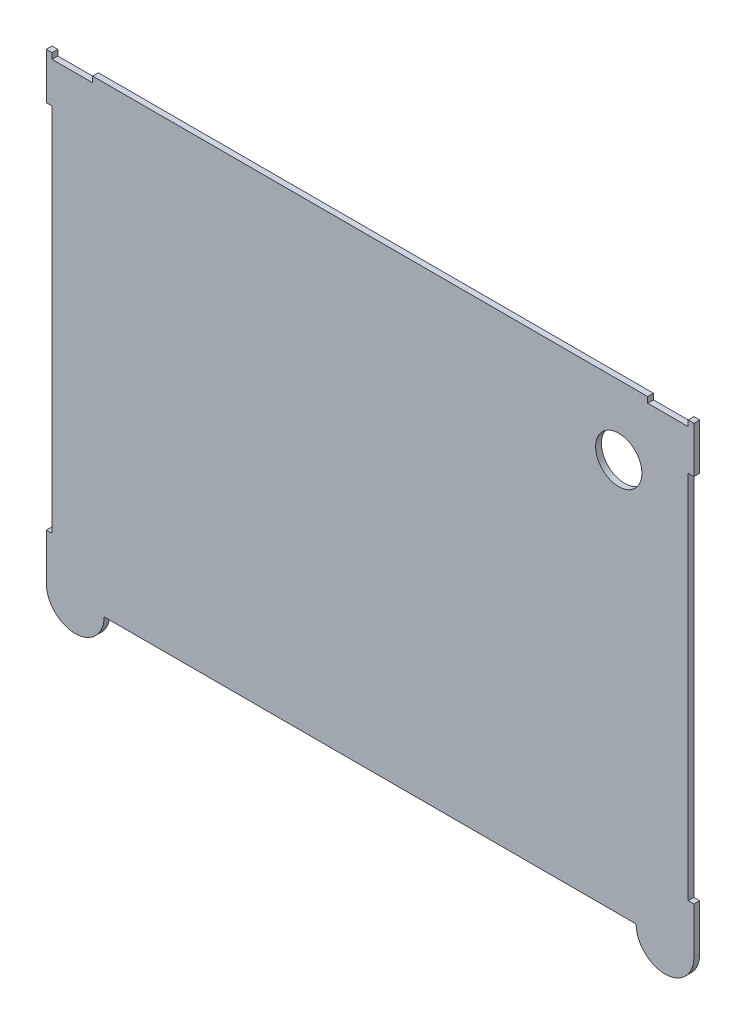
ISO-10303-21;
HEADER;
FILE_DESCRIPTION(('STEP AP214'),'2;1');
FILE_NAME('part.step','',(''),(''),'','','');
FILE_SCHEMA(('AUTOMOTIVE_DESIGN { 1 0 10303 214 1 1 1 1 }'));
ENDSEC;
DATA;
#1=APPLICATION_CONTEXT('core data for automotive mechanical design processes');
#2=APPLICATION_PROTOCOL_DEFINITION('international standard','automotive_design',2000,#1);
#3=PRODUCT_CONTEXT('',#1,'mechanical');
#4=PRODUCT('Part','Part','',(#3));
#5=PRODUCT_RELATED_PRODUCT_CATEGORY('part','',(#4));
#6=PRODUCT_DEFINITION_FORMATION('','',#4);
#7=PRODUCT_DEFINITION_CONTEXT('part definition',#1,'design');
#8=PRODUCT_DEFINITION('design','',#6,#7);
#9=PRODUCT_DEFINITION_SHAPE('','',#8);
#10=(LENGTH_UNIT() NAMED_UNIT(*) SI_UNIT(.MILLI.,.METRE.));
#11=(NAMED_UNIT(*) PLANE_ANGLE_UNIT() SI_UNIT($,.RADIAN.));
#12=(NAMED_UNIT(*) SI_UNIT($,.STERADIAN.) SOLID_ANGLE_UNIT());
#13=UNCERTAINTY_MEASURE_WITH_UNIT(LENGTH_MEASURE(1.E-05),#10,'distance_accuracy_value','');
#14=(GEOMETRIC_REPRESENTATION_CONTEXT(3) GLOBAL_UNCERTAINTY_ASSIGNED_CONTEXT((#13)) GLOBAL_UNIT_ASSIGNED_CONTEXT((#10,
#11,#12)) REPRESENTATION_CONTEXT('',''));
#15=CARTESIAN_POINT('',(0.,0.,0.));
#16=DIRECTION('',(0.,0.,1.));
#17=DIRECTION('',(1.,0.,0.));
#18=AXIS2_PLACEMENT_3D('',#15,#16,#17);
#19=CARTESIAN_POINT('',(15.875,0.,3.175));
#20=DIRECTION('',(0.,0.,-1.));
#21=DIRECTION('',(-1.,0.,0.));
#22=AXIS2_PLACEMENT_3D('',#19,#20,#21);
#23=CYLINDRICAL_SURFACE('',#22,15.875);
#24=CARTESIAN_POINT('',(15.875,0.,0.));
#25=DIRECTION('',(0.,0.,1.));
#26=DIRECTION('',(1.,0.,0.));
#27=AXIS2_PLACEMENT_3D('',#24,#25,#26);
#28=CIRCLE('',#27,15.875);
#29=CARTESIAN_POINT('',(0.,0.,0.));
#30=VERTEX_POINT('',#29);
#31=CARTESIAN_POINT('',(31.75,0.,0.));
#32=VERTEX_POINT('',#31);
#33=EDGE_CURVE('E214',#30,#32,#28,.T.);
#34=ORIENTED_EDGE('',*,*,#33,.T.);
#35=DIRECTION('',(0.,0.,-1.));
#36=VECTOR('',#35,1.);
#37=CARTESIAN_POINT('',(31.75,0.,3.175));
#38=LINE('',#37,#36);
#39=CARTESIAN_POINT('',(31.75,0.,3.175));
#40=VERTEX_POINT('',#39);
#41=EDGE_CURVE('E11',#40,#32,#38,.T.);
#42=ORIENTED_EDGE('',*,*,#41,.F.);
#43=CARTESIAN_POINT('',(15.875,0.,3.175));
#44=DIRECTION('',(0.,0.,1.));
#45=DIRECTION('',(1.,0.,0.));
#46=AXIS2_PLACEMENT_3D('',#43,#44,#45);
#47=CIRCLE('',#46,15.875);
#48=CARTESIAN_POINT('',(0.,0.,3.175));
#49=VERTEX_POINT('',#48);
#50=EDGE_CURVE('E259',#49,#40,#47,.T.);
#51=ORIENTED_EDGE('',*,*,#50,.F.);
#52=DIRECTION('',(0.,0.,-1.));
#53=VECTOR('',#52,1.);
#54=CARTESIAN_POINT('',(0.,0.,3.175));
#55=LINE('',#54,#53);
#56=EDGE_CURVE('E210',#49,#30,#55,.T.);
#57=ORIENTED_EDGE('',*,*,#56,.T.);
#58=EDGE_LOOP('',(#34,#42,#51,#57));
#59=FACE_BOUND('',#58,.T.);
#60=ADVANCED_FACE('F34',(#59),#23,.T.);
#61=CARTESIAN_POINT('',(31.75,0.,3.175));
#62=DIRECTION('',(0.,1.,0.));
#63=DIRECTION('',(0.,0.,1.));
#64=AXIS2_PLACEMENT_3D('',#61,#62,#63);
#65=PLANE('',#64);
#66=DIRECTION('',(1.,0.,0.));
#67=VECTOR('',#66,1.);
#68=CARTESIAN_POINT('',(31.75,0.,0.));
#69=LINE('',#68,#67);
#70=CARTESIAN_POINT('',(323.85,0.,0.));
#71=VERTEX_POINT('',#70);
#72=EDGE_CURVE('E217',#32,#71,#69,.T.);
#73=ORIENTED_EDGE('',*,*,#72,.T.);
#74=DIRECTION('',(0.,0.,-1.));
#75=VECTOR('',#74,1.);
#76=CARTESIAN_POINT('',(323.85,0.,3.175));
#77=LINE('',#76,#75);
#78=CARTESIAN_POINT('',(323.85,0.,3.175));
#79=VERTEX_POINT('',#78);
#80=EDGE_CURVE('E42',#79,#71,#77,.T.);
#81=ORIENTED_EDGE('',*,*,#80,.F.);
#82=DIRECTION('',(1.,0.,0.));
#83=VECTOR('',#82,1.);
#84=CARTESIAN_POINT('',(31.75,0.,3.175));
#85=LINE('',#84,#83);
#86=EDGE_CURVE('E135',#40,#79,#85,.T.);
#87=ORIENTED_EDGE('',*,*,#86,.F.);
#88=ORIENTED_EDGE('',*,*,#41,.T.);
#89=EDGE_LOOP('',(#73,#81,#87,#88));
#90=FACE_BOUND('',#89,.T.);
#91=ADVANCED_FACE('F388',(#90),#65,.F.);
#92=CARTESIAN_POINT('',(339.725,0.,3.175));
#93=DIRECTION('',(0.,0.,-1.));
#94=DIRECTION('',(-1.,0.,0.));
#95=AXIS2_PLACEMENT_3D('',#92,#93,#94);
#96=CYLINDRICAL_SURFACE('',#95,15.875);
#97=CARTESIAN_POINT('',(339.725,0.,0.));
#98=DIRECTION('',(0.,0.,1.));
#99=DIRECTION('',(-1.,0.,0.));
#100=AXIS2_PLACEMENT_3D('',#97,#98,#99);
#101=CIRCLE('',#100,15.875);
#102=CARTESIAN_POINT('',(355.6,0.,0.));
#103=VERTEX_POINT('',#102);
#104=EDGE_CURVE('E220',#71,#103,#101,.T.);
#105=ORIENTED_EDGE('',*,*,#104,.T.);
#106=DIRECTION('',(0.,0.,-1.));
#107=VECTOR('',#106,1.);
#108=CARTESIAN_POINT('',(355.6,0.,3.175));
#109=LINE('',#108,#107);
#110=CARTESIAN_POINT('',(355.6,0.,3.175));
#111=VERTEX_POINT('',#110);
#112=EDGE_CURVE('E308',#111,#103,#109,.T.);
#113=ORIENTED_EDGE('',*,*,#112,.F.);
#114=CARTESIAN_POINT('',(339.725,0.,3.175));
#115=DIRECTION('',(0.,0.,1.));
#116=DIRECTION('',(-1.,0.,0.));
#117=AXIS2_PLACEMENT_3D('',#114,#115,#116);
#118=CIRCLE('',#117,15.875);
#119=EDGE_CURVE('E316',#79,#111,#118,.T.);
#120=ORIENTED_EDGE('',*,*,#119,.F.);
#121=ORIENTED_EDGE('',*,*,#80,.T.);
#122=EDGE_LOOP('',(#105,#113,#120,#121));
#123=FACE_BOUND('',#122,.T.);
#124=ADVANCED_FACE('F314',(#123),#96,.T.);
#125=CARTESIAN_POINT('',(355.6,0.,3.175));
#126=DIRECTION('',(-1.,0.,0.));
#127=DIRECTION('',(0.,0.,1.));
#128=AXIS2_PLACEMENT_3D('',#125,#126,#127);
#129=PLANE('',#128);
#130=DIRECTION('',(0.,1.,0.));
#131=VECTOR('',#130,1.);
#132=CARTESIAN_POINT('',(355.6,0.,0.));
#133=LINE('',#132,#131);
#134=CARTESIAN_POINT('',(355.6,25.4,0.));
#135=VERTEX_POINT('',#134);
#136=EDGE_CURVE('E222',#103,#135,#133,.T.);
#137=ORIENTED_EDGE('',*,*,#136,.T.);
#138=DIRECTION('',(0.,0.,-1.));
#139=VECTOR('',#138,1.);
#140=CARTESIAN_POINT('',(355.6,25.4,3.175));
#141=LINE('',#140,#139);
#142=CARTESIAN_POINT('',(355.6,25.4,3.175));
#143=VERTEX_POINT('',#142);
#144=EDGE_CURVE('E305',#143,#135,#141,.T.);
#145=ORIENTED_EDGE('',*,*,#144,.F.);
#146=DIRECTION('',(0.,1.,0.));
#147=VECTOR('',#146,1.);
#148=CARTESIAN_POINT('',(355.6,0.,3.175));
#149=LINE('',#148,#147);
#150=EDGE_CURVE('E334',#111,#143,#149,.T.);
#151=ORIENTED_EDGE('',*,*,#150,.F.);
#152=ORIENTED_EDGE('',*,*,#112,.T.);
#153=EDGE_LOOP('',(#137,#145,#151,#152));
#154=FACE_BOUND('',#153,.T.);
#155=ADVANCED_FACE('F325',(#154),#129,.F.);
#156=CARTESIAN_POINT('',(355.6,25.4,3.175));
#157=DIRECTION('',(0.,-1.,0.));
#158=DIRECTION('',(1.,0.,0.));
#159=AXIS2_PLACEMENT_3D('',#156,#157,#158);
#160=PLANE('',#159);
#161=DIRECTION('',(-1.,0.,0.));
#162=VECTOR('',#161,1.);
#163=CARTESIAN_POINT('',(355.6,25.4,0.));
#164=LINE('',#163,#162);
#165=CARTESIAN_POINT('',(352.425,25.4,0.));
#166=VERTEX_POINT('',#165);
#167=EDGE_CURVE('E224',#135,#166,#164,.T.);
#168=ORIENTED_EDGE('',*,*,#167,.T.);
#169=DIRECTION('',(0.,0.,-1.));
#170=VECTOR('',#169,1.);
#171=CARTESIAN_POINT('',(352.425,25.4,3.175));
#172=LINE('',#171,#170);
#173=CARTESIAN_POINT('',(352.425,25.4,3.175));
#174=VERTEX_POINT('',#173);
#175=EDGE_CURVE('E302',#174,#166,#172,.T.);
#176=ORIENTED_EDGE('',*,*,#175,.F.);
#177=DIRECTION('',(-1.,0.,0.));
#178=VECTOR('',#177,1.);
#179=CARTESIAN_POINT('',(355.6,25.4,3.175));
#180=LINE('',#179,#178);
#181=EDGE_CURVE('E331',#143,#174,#180,.T.);
#182=ORIENTED_EDGE('',*,*,#181,.F.);
#183=ORIENTED_EDGE('',*,*,#144,.T.);
#184=EDGE_LOOP('',(#168,#176,#182,#183));
#185=FACE_BOUND('',#184,.T.);
#186=ADVANCED_FACE('F329',(#185),#160,.F.);
#187=CARTESIAN_POINT('',(352.425,228.6,3.175));
#188=DIRECTION('',(-1.,0.,0.));
#189=DIRECTION('',(0.,0.,1.));
#190=AXIS2_PLACEMENT_3D('',#187,#188,#189);
#191=PLANE('',#190);
#192=DIRECTION('',(0.,1.,0.));
#193=VECTOR('',#192,1.);
#194=CARTESIAN_POINT('',(352.425,228.6,0.));
#195=LINE('',#194,#193);
#196=CARTESIAN_POINT('',(352.425,228.6,0.));
#197=VERTEX_POINT('',#196);
#198=EDGE_CURVE('E226',#166,#197,#195,.T.);
#199=ORIENTED_EDGE('',*,*,#198,.T.);
#200=DIRECTION('',(0.,0.,-1.));
#201=VECTOR('',#200,1.);
#202=CARTESIAN_POINT('',(352.425,228.6,3.175));
#203=LINE('',#202,#201);
#204=CARTESIAN_POINT('',(352.425,228.6,3.175));
#205=VERTEX_POINT('',#204);
#206=EDGE_CURVE('E299',#205,#197,#203,.T.);
#207=ORIENTED_EDGE('',*,*,#206,.F.);
#208=DIRECTION('',(0.,1.,0.));
#209=VECTOR('',#208,1.);
#210=CARTESIAN_POINT('',(352.425,228.6,3.175));
#211=LINE('',#210,#209);
#212=EDGE_CURVE('E333',#174,#205,#211,.T.);
#213=ORIENTED_EDGE('',*,*,#212,.F.);
#214=ORIENTED_EDGE('',*,*,#175,.T.);
#215=EDGE_LOOP('',(#199,#207,#213,#214));
#216=FACE_BOUND('',#215,.T.);
#217=ADVANCED_FACE('F401',(#216),#191,.F.);
#218=CARTESIAN_POINT('',(355.6,228.6,3.175));
#219=DIRECTION('',(0.,1.,0.));
#220=DIRECTION('',(0.,0.,1.));
#221=AXIS2_PLACEMENT_3D('',#218,#219,#220);
#222=PLANE('',#221);
#223=DIRECTION('',(1.,0.,0.));
#224=VECTOR('',#223,1.);
#225=CARTESIAN_POINT('',(355.6,228.6,0.));
#226=LINE('',#225,#224);
#227=CARTESIAN_POINT('',(355.6,228.6,0.));
#228=VERTEX_POINT('',#227);
#229=EDGE_CURVE('E228',#197,#228,#226,.T.);
#230=ORIENTED_EDGE('',*,*,#229,.T.);
#231=DIRECTION('',(0.,0.,-1.));
#232=VECTOR('',#231,1.);
#233=CARTESIAN_POINT('',(355.6,228.6,3.175));
#234=LINE('',#233,#232);
#235=CARTESIAN_POINT('',(355.6,228.6,3.175));
#236=VERTEX_POINT('',#235);
#237=EDGE_CURVE('E296',#236,#228,#234,.T.);
#238=ORIENTED_EDGE('',*,*,#237,.F.);
#239=DIRECTION('',(1.,0.,0.));
#240=VECTOR('',#239,1.);
#241=CARTESIAN_POINT('',(355.6,228.6,3.175));
#242=LINE('',#241,#240);
#243=EDGE_CURVE('E336',#205,#236,#242,.T.);
#244=ORIENTED_EDGE('',*,*,#243,.F.);
#245=ORIENTED_EDGE('',*,*,#206,.T.);
#246=EDGE_LOOP('',(#230,#238,#244,#245));
#247=FACE_BOUND('',#246,.T.);
#248=ADVANCED_FACE('F404',(#247),#222,.F.);
#249=CARTESIAN_POINT('',(355.6,250.825,3.175));
#250=DIRECTION('',(-1.,0.,0.));
#251=DIRECTION('',(0.,0.,1.));
#252=AXIS2_PLACEMENT_3D('',#249,#250,#251);
#253=PLANE('',#252);
#254=DIRECTION('',(0.,1.,0.));
#255=VECTOR('',#254,1.);
#256=CARTESIAN_POINT('',(355.6,250.825,0.));
#257=LINE('',#256,#255);
#258=CARTESIAN_POINT('',(355.6,254.,0.));
#259=VERTEX_POINT('',#258);
#260=EDGE_CURVE('E231',#228,#259,#257,.T.);
#261=ORIENTED_EDGE('',*,*,#260,.T.);
#262=DIRECTION('',(0.,0.,-1.));
#263=VECTOR('',#262,1.);
#264=CARTESIAN_POINT('',(355.6,254.,3.175));
#265=LINE('',#264,#263);
#266=CARTESIAN_POINT('',(355.6,254.,3.175));
#267=VERTEX_POINT('',#266);
#268=EDGE_CURVE('E293',#267,#259,#265,.T.);
#269=ORIENTED_EDGE('',*,*,#268,.F.);
#270=DIRECTION('',(0.,1.,0.));
#271=VECTOR('',#270,1.);
#272=CARTESIAN_POINT('',(355.6,228.6,3.175));
#273=LINE('',#272,#271);
#274=EDGE_CURVE('E342',#236,#267,#273,.T.);
#275=ORIENTED_EDGE('',*,*,#274,.F.);
#276=ORIENTED_EDGE('',*,*,#237,.T.);
#277=EDGE_LOOP('',(#261,#269,#275,#276));
#278=FACE_BOUND('',#277,.T.);
#279=ADVANCED_FACE('F408',(#278),#253,.F.);
#280=CARTESIAN_POINT('',(355.6,254.,3.175));
#281=DIRECTION('',(0.,-1.,0.));
#282=DIRECTION('',(0.,0.,-1.));
#283=AXIS2_PLACEMENT_3D('',#280,#281,#282);
#284=PLANE('',#283);
#285=DIRECTION('',(-1.,0.,0.));
#286=VECTOR('',#285,1.);
#287=CARTESIAN_POINT('',(355.6,254.,0.));
#288=LINE('',#287,#286);
#289=CARTESIAN_POINT('',(352.425,254.,0.));
#290=VERTEX_POINT('',#289);
#291=EDGE_CURVE('E233',#259,#290,#288,.T.);
#292=ORIENTED_EDGE('',*,*,#291,.T.);
#293=DIRECTION('',(0.,0.,-1.));
#294=VECTOR('',#293,1.);
#295=CARTESIAN_POINT('',(352.425,254.,3.175));
#296=LINE('',#295,#294);
#297=CARTESIAN_POINT('',(352.425,254.,3.175));
#298=VERTEX_POINT('',#297);
#299=EDGE_CURVE('E290',#298,#290,#296,.T.);
#300=ORIENTED_EDGE('',*,*,#299,.F.);
#301=DIRECTION('',(-1.,0.,0.));
#302=VECTOR('',#301,1.);
#303=CARTESIAN_POINT('',(355.6,254.,3.175));
#304=LINE('',#303,#302);
#305=EDGE_CURVE('E344',#267,#298,#304,.T.);
#306=ORIENTED_EDGE('',*,*,#305,.F.);
#307=ORIENTED_EDGE('',*,*,#268,.T.);
#308=EDGE_LOOP('',(#292,#300,#306,#307));
#309=FACE_BOUND('',#308,.T.);
#310=ADVANCED_FACE('F412',(#309),#284,.F.);
#311=CARTESIAN_POINT('',(352.425,254.,3.175));
#312=DIRECTION('',(1.,0.,0.));
#313=DIRECTION('',(0.,0.,-1.));
#314=AXIS2_PLACEMENT_3D('',#311,#312,#313);
#315=PLANE('',#314);
#316=DIRECTION('',(0.,-1.,0.));
#317=VECTOR('',#316,1.);
#318=CARTESIAN_POINT('',(352.425,254.,0.));
#319=LINE('',#318,#317);
#320=CARTESIAN_POINT('',(352.425,250.825,0.));
#321=VERTEX_POINT('',#320);
#322=EDGE_CURVE('E235',#290,#321,#319,.T.);
#323=ORIENTED_EDGE('',*,*,#322,.T.);
#324=DIRECTION('',(0.,0.,-1.));
#325=VECTOR('',#324,1.);
#326=CARTESIAN_POINT('',(352.425,250.825,3.175));
#327=LINE('',#326,#325);
#328=CARTESIAN_POINT('',(352.425,250.825,3.175));
#329=VERTEX_POINT('',#328);
#330=EDGE_CURVE('E287',#329,#321,#327,.T.);
#331=ORIENTED_EDGE('',*,*,#330,.F.);
#332=DIRECTION('',(0.,-1.,0.));
#333=VECTOR('',#332,1.);
#334=CARTESIAN_POINT('',(352.425,254.,3.175));
#335=LINE('',#334,#333);
#336=EDGE_CURVE('E346',#298,#329,#335,.T.);
#337=ORIENTED_EDGE('',*,*,#336,.F.);
#338=ORIENTED_EDGE('',*,*,#299,.T.);
#339=EDGE_LOOP('',(#323,#331,#337,#338));
#340=FACE_BOUND('',#339,.T.);
#341=ADVANCED_FACE('F416',(#340),#315,.F.);
#342=CARTESIAN_POINT('',(330.2,250.825,3.175));
#343=DIRECTION('',(0.,-1.,0.));
#344=DIRECTION('',(0.,0.,-1.));
#345=AXIS2_PLACEMENT_3D('',#342,#343,#344);
#346=PLANE('',#345);
#347=DIRECTION('',(-1.,0.,0.));
#348=VECTOR('',#347,1.);
#349=CARTESIAN_POINT('',(330.2,250.825,0.));
#350=LINE('',#349,#348);
#351=CARTESIAN_POINT('',(330.2,250.825,0.));
#352=VERTEX_POINT('',#351);
#353=EDGE_CURVE('E237',#321,#352,#350,.T.);
#354=ORIENTED_EDGE('',*,*,#353,.T.);
#355=DIRECTION('',(0.,0.,-1.));
#356=VECTOR('',#355,1.);
#357=CARTESIAN_POINT('',(330.2,250.825,3.175));
#358=LINE('',#357,#356);
#359=CARTESIAN_POINT('',(330.2,250.825,3.175));
#360=VERTEX_POINT('',#359);
#361=EDGE_CURVE('E284',#360,#352,#358,.T.);
#362=ORIENTED_EDGE('',*,*,#361,.F.);
#363=DIRECTION('',(-1.,0.,0.));
#364=VECTOR('',#363,1.);
#365=CARTESIAN_POINT('',(330.2,250.825,3.175));
#366=LINE('',#365,#364);
#367=EDGE_CURVE('E348',#329,#360,#366,.T.);
#368=ORIENTED_EDGE('',*,*,#367,.F.);
#369=ORIENTED_EDGE('',*,*,#330,.T.);
#370=EDGE_LOOP('',(#354,#362,#368,#369));
#371=FACE_BOUND('',#370,.T.);
#372=ADVANCED_FACE('F420',(#371),#346,.F.);
#373=CARTESIAN_POINT('',(330.2,254.,3.175));
#374=DIRECTION('',(-1.,0.,0.));
#375=DIRECTION('',(0.,0.,1.));
#376=AXIS2_PLACEMENT_3D('',#373,#374,#375);
#377=PLANE('',#376);
#378=DIRECTION('',(0.,1.,0.));
#379=VECTOR('',#378,1.);
#380=CARTESIAN_POINT('',(330.2,254.,0.));
#381=LINE('',#380,#379);
#382=CARTESIAN_POINT('',(330.2,254.,0.));
#383=VERTEX_POINT('',#382);
#384=EDGE_CURVE('E239',#352,#383,#381,.T.);
#385=ORIENTED_EDGE('',*,*,#384,.T.);
#386=DIRECTION('',(0.,0.,-1.));
#387=VECTOR('',#386,1.);
#388=CARTESIAN_POINT('',(330.2,254.,3.175));
#389=LINE('',#388,#387);
#390=CARTESIAN_POINT('',(330.2,254.,3.175));
#391=VERTEX_POINT('',#390);
#392=EDGE_CURVE('E281',#391,#383,#389,.T.);
#393=ORIENTED_EDGE('',*,*,#392,.F.);
#394=DIRECTION('',(0.,1.,0.));
#395=VECTOR('',#394,1.);
#396=CARTESIAN_POINT('',(330.2,254.,3.175));
#397=LINE('',#396,#395);
#398=EDGE_CURVE('E350',#360,#391,#397,.T.);
#399=ORIENTED_EDGE('',*,*,#398,.F.);
#400=ORIENTED_EDGE('',*,*,#361,.T.);
#401=EDGE_LOOP('',(#385,#393,#399,#400));
#402=FACE_BOUND('',#401,.T.);
#403=ADVANCED_FACE('F424',(#402),#377,.F.);
#404=CARTESIAN_POINT('',(25.4,254.,3.175));
#405=DIRECTION('',(0.,-1.,0.));
#406=DIRECTION('',(0.,0.,-1.));
#407=AXIS2_PLACEMENT_3D('',#404,#405,#406);
#408=PLANE('',#407);
#409=DIRECTION('',(-1.,0.,0.));
#410=VECTOR('',#409,1.);
#411=CARTESIAN_POINT('',(25.4,254.,0.));
#412=LINE('',#411,#410);
#413=CARTESIAN_POINT('',(25.4,254.,0.));
#414=VERTEX_POINT('',#413);
#415=EDGE_CURVE('E241',#383,#414,#412,.T.);
#416=ORIENTED_EDGE('',*,*,#415,.T.);
#417=DIRECTION('',(0.,0.,-1.));
#418=VECTOR('',#417,1.);
#419=CARTESIAN_POINT('',(25.4,254.,3.175));
#420=LINE('',#419,#418);
#421=CARTESIAN_POINT('',(25.4,254.,3.175));
#422=VERTEX_POINT('',#421);
#423=EDGE_CURVE('E278',#422,#414,#420,.T.);
#424=ORIENTED_EDGE('',*,*,#423,.F.);
#425=DIRECTION('',(-1.,0.,0.));
#426=VECTOR('',#425,1.);
#427=CARTESIAN_POINT('',(25.4,254.,3.175));
#428=LINE('',#427,#426);
#429=EDGE_CURVE('E352',#391,#422,#428,.T.);
#430=ORIENTED_EDGE('',*,*,#429,.F.);
#431=ORIENTED_EDGE('',*,*,#392,.T.);
#432=EDGE_LOOP('',(#416,#424,#430,#431));
#433=FACE_BOUND('',#432,.T.);
#434=ADVANCED_FACE('F428',(#433),#408,.F.);
#435=CARTESIAN_POINT('',(25.4,250.825,3.175));
#436=DIRECTION('',(1.,0.,0.));
#437=DIRECTION('',(0.,0.,-1.));
#438=AXIS2_PLACEMENT_3D('',#435,#436,#437);
#439=PLANE('',#438);
#440=DIRECTION('',(0.,-1.,0.));
#441=VECTOR('',#440,1.);
#442=CARTESIAN_POINT('',(25.4,250.825,0.));
#443=LINE('',#442,#441);
#444=CARTESIAN_POINT('',(25.4,250.825,0.));
#445=VERTEX_POINT('',#444);
#446=EDGE_CURVE('E243',#414,#445,#443,.T.);
#447=ORIENTED_EDGE('',*,*,#446,.T.);
#448=DIRECTION('',(0.,0.,-1.));
#449=VECTOR('',#448,1.);
#450=CARTESIAN_POINT('',(25.4,250.825,3.175));
#451=LINE('',#450,#449);
#452=CARTESIAN_POINT('',(25.4,250.825,3.175));
#453=VERTEX_POINT('',#452);
#454=EDGE_CURVE('E275',#453,#445,#451,.T.);
#455=ORIENTED_EDGE('',*,*,#454,.F.);
#456=DIRECTION('',(0.,-1.,0.));
#457=VECTOR('',#456,1.);
#458=CARTESIAN_POINT('',(25.4,250.825,3.175));
#459=LINE('',#458,#457);
#460=EDGE_CURVE('E354',#422,#453,#459,.T.);
#461=ORIENTED_EDGE('',*,*,#460,.F.);
#462=ORIENTED_EDGE('',*,*,#423,.T.);
#463=EDGE_LOOP('',(#447,#455,#461,#462));
#464=FACE_BOUND('',#463,.T.);
#465=ADVANCED_FACE('F432',(#464),#439,.F.);
#466=CARTESIAN_POINT('',(3.17499999999997,250.825,3.175));
#467=DIRECTION('',(0.,-1.,0.));
#468=DIRECTION('',(0.,0.,-1.));
#469=AXIS2_PLACEMENT_3D('',#466,#467,#468);
#470=PLANE('',#469);
#471=DIRECTION('',(-1.,0.,0.));
#472=VECTOR('',#471,1.);
#473=CARTESIAN_POINT('',(3.17499999999997,250.825,0.));
#474=LINE('',#473,#472);
#475=CARTESIAN_POINT('',(3.17499999999997,250.825,0.));
#476=VERTEX_POINT('',#475);
#477=EDGE_CURVE('E245',#445,#476,#474,.T.);
#478=ORIENTED_EDGE('',*,*,#477,.T.);
#479=DIRECTION('',(0.,0.,-1.));
#480=VECTOR('',#479,1.);
#481=CARTESIAN_POINT('',(3.17499999999997,250.825,3.175));
#482=LINE('',#481,#480);
#483=CARTESIAN_POINT('',(3.17499999999997,250.825,3.175));
#484=VERTEX_POINT('',#483);
#485=EDGE_CURVE('E272',#484,#476,#482,.T.);
#486=ORIENTED_EDGE('',*,*,#485,.F.);
#487=DIRECTION('',(-1.,0.,0.));
#488=VECTOR('',#487,1.);
#489=CARTESIAN_POINT('',(3.17499999999997,250.825,3.175));
#490=LINE('',#489,#488);
#491=EDGE_CURVE('E356',#453,#484,#490,.T.);
#492=ORIENTED_EDGE('',*,*,#491,.F.);
#493=ORIENTED_EDGE('',*,*,#454,.T.);
#494=EDGE_LOOP('',(#478,#486,#492,#493));
#495=FACE_BOUND('',#494,.T.);
#496=ADVANCED_FACE('F436',(#495),#470,.F.);
#497=CARTESIAN_POINT('',(3.17499999999997,254.,3.175));
#498=DIRECTION('',(-1.,0.,0.));
#499=DIRECTION('',(0.,0.,1.));
#500=AXIS2_PLACEMENT_3D('',#497,#498,#499);
#501=PLANE('',#500);
#502=DIRECTION('',(0.,1.,0.));
#503=VECTOR('',#502,1.);
#504=CARTESIAN_POINT('',(3.17499999999997,254.,0.));
#505=LINE('',#504,#503);
#506=CARTESIAN_POINT('',(3.17499999999997,254.,0.));
#507=VERTEX_POINT('',#506);
#508=EDGE_CURVE('E247',#476,#507,#505,.T.);
#509=ORIENTED_EDGE('',*,*,#508,.T.);
#510=DIRECTION('',(0.,0.,-1.));
#511=VECTOR('',#510,1.);
#512=CARTESIAN_POINT('',(3.17499999999997,254.,3.175));
#513=LINE('',#512,#511);
#514=CARTESIAN_POINT('',(3.17499999999997,254.,3.175));
#515=VERTEX_POINT('',#514);
#516=EDGE_CURVE('E269',#515,#507,#513,.T.);
#517=ORIENTED_EDGE('',*,*,#516,.F.);
#518=DIRECTION('',(0.,1.,0.));
#519=VECTOR('',#518,1.);
#520=CARTESIAN_POINT('',(3.17499999999997,254.,3.175));
#521=LINE('',#520,#519);
#522=EDGE_CURVE('E358',#484,#515,#521,.T.);
#523=ORIENTED_EDGE('',*,*,#522,.F.);
#524=ORIENTED_EDGE('',*,*,#485,.T.);
#525=EDGE_LOOP('',(#509,#517,#523,#524));
#526=FACE_BOUND('',#525,.T.);
#527=ADVANCED_FACE('F440',(#526),#501,.F.);
#528=CARTESIAN_POINT('',(0.,254.,3.175));
#529=DIRECTION('',(0.,-1.,0.));
#530=DIRECTION('',(0.,0.,-1.));
#531=AXIS2_PLACEMENT_3D('',#528,#529,#530);
#532=PLANE('',#531);
#533=DIRECTION('',(-1.,0.,0.));
#534=VECTOR('',#533,1.);
#535=CARTESIAN_POINT('',(0.,254.,0.));
#536=LINE('',#535,#534);
#537=CARTESIAN_POINT('',(0.,254.,0.));
#538=VERTEX_POINT('',#537);
#539=EDGE_CURVE('E249',#507,#538,#536,.T.);
#540=ORIENTED_EDGE('',*,*,#539,.T.);
#541=DIRECTION('',(0.,0.,-1.));
#542=VECTOR('',#541,1.);
#543=CARTESIAN_POINT('',(0.,254.,3.175));
#544=LINE('',#543,#542);
#545=CARTESIAN_POINT('',(0.,254.,3.175));
#546=VERTEX_POINT('',#545);
#547=EDGE_CURVE('E266',#546,#538,#544,.T.);
#548=ORIENTED_EDGE('',*,*,#547,.F.);
#549=DIRECTION('',(-1.,0.,0.));
#550=VECTOR('',#549,1.);
#551=CARTESIAN_POINT('',(0.,254.,3.175));
#552=LINE('',#551,#550);
#553=EDGE_CURVE('E360',#515,#546,#552,.T.);
#554=ORIENTED_EDGE('',*,*,#553,.F.);
#555=ORIENTED_EDGE('',*,*,#516,.T.);
#556=EDGE_LOOP('',(#540,#548,#554,#555));
#557=FACE_BOUND('',#556,.T.);
#558=ADVANCED_FACE('F444',(#557),#532,.F.);
#559=CARTESIAN_POINT('',(0.,228.6,3.175));
#560=DIRECTION('',(1.,0.,0.));
#561=DIRECTION('',(0.,1.,0.));
#562=AXIS2_PLACEMENT_3D('',#559,#560,#561);
#563=PLANE('',#562);
#564=DIRECTION('',(0.,-1.,0.));
#565=VECTOR('',#564,1.);
#566=CARTESIAN_POINT('',(0.,228.6,0.));
#567=LINE('',#566,#565);
#568=CARTESIAN_POINT('',(0.,228.6,0.));
#569=VERTEX_POINT('',#568);
#570=EDGE_CURVE('E252',#538,#569,#567,.T.);
#571=ORIENTED_EDGE('',*,*,#570,.T.);
#572=DIRECTION('',(0.,0.,-1.));
#573=VECTOR('',#572,1.);
#574=CARTESIAN_POINT('',(0.,228.6,3.175));
#575=LINE('',#574,#573);
#576=CARTESIAN_POINT('',(0.,228.6,3.175));
#577=VERTEX_POINT('',#576);
#578=EDGE_CURVE('E263',#577,#569,#575,.T.);
#579=ORIENTED_EDGE('',*,*,#578,.F.);
#580=DIRECTION('',(0.,-1.,0.));
#581=VECTOR('',#580,1.);
#582=CARTESIAN_POINT('',(0.,250.825,3.175));
#583=LINE('',#582,#581);
#584=EDGE_CURVE('E362',#546,#577,#583,.T.);
#585=ORIENTED_EDGE('',*,*,#584,.F.);
#586=ORIENTED_EDGE('',*,*,#547,.T.);
#587=EDGE_LOOP('',(#571,#579,#585,#586));
#588=FACE_BOUND('',#587,.T.);
#589=ADVANCED_FACE('F368',(#588),#563,.F.);
#590=CARTESIAN_POINT('',(0.,228.6,3.175));
#591=DIRECTION('',(0.,1.,0.));
#592=DIRECTION('',(0.,0.,1.));
#593=AXIS2_PLACEMENT_3D('',#590,#591,#592);
#594=PLANE('',#593);
#595=DIRECTION('',(1.,0.,0.));
#596=VECTOR('',#595,1.);
#597=CARTESIAN_POINT('',(0.,228.6,0.));
#598=LINE('',#597,#596);
#599=CARTESIAN_POINT('',(3.17499999999997,228.6,0.));
#600=VERTEX_POINT('',#599);
#601=EDGE_CURVE('E254',#569,#600,#598,.T.);
#602=ORIENTED_EDGE('',*,*,#601,.T.);
#603=DIRECTION('',(0.,0.,-1.));
#604=VECTOR('',#603,1.);
#605=CARTESIAN_POINT('',(3.17499999999997,228.6,3.175));
#606=LINE('',#605,#604);
#607=CARTESIAN_POINT('',(3.17499999999997,228.6,3.175));
#608=VERTEX_POINT('',#607);
#609=EDGE_CURVE('E205',#608,#600,#606,.T.);
#610=ORIENTED_EDGE('',*,*,#609,.F.);
#611=DIRECTION('',(1.,0.,0.));
#612=VECTOR('',#611,1.);
#613=CARTESIAN_POINT('',(0.,228.6,3.175));
#614=LINE('',#613,#612);
#615=EDGE_CURVE('E196',#577,#608,#614,.T.);
#616=ORIENTED_EDGE('',*,*,#615,.F.);
#617=ORIENTED_EDGE('',*,*,#578,.T.);
#618=EDGE_LOOP('',(#602,#610,#616,#617));
#619=FACE_BOUND('',#618,.T.);
#620=ADVANCED_FACE('F371',(#619),#594,.F.);
#621=CARTESIAN_POINT('',(3.17499999999997,228.6,3.175));
#622=DIRECTION('',(1.,0.,0.));
#623=DIRECTION('',(0.,1.,0.));
#624=AXIS2_PLACEMENT_3D('',#621,#622,#623);
#625=PLANE('',#624);
#626=DIRECTION('',(0.,-1.,0.));
#627=VECTOR('',#626,1.);
#628=CARTESIAN_POINT('',(3.17499999999997,228.6,0.));
#629=LINE('',#628,#627);
#630=CARTESIAN_POINT('',(3.17499999999995,25.4,0.));
#631=VERTEX_POINT('',#630);
#632=EDGE_CURVE('E204',#600,#631,#629,.T.);
#633=ORIENTED_EDGE('',*,*,#632,.T.);
#634=DIRECTION('',(0.,0.,-1.));
#635=VECTOR('',#634,1.);
#636=CARTESIAN_POINT('',(3.17499999999995,25.4,3.175));
#637=LINE('',#636,#635);
#638=CARTESIAN_POINT('',(3.17499999999995,25.4,3.175));
#639=VERTEX_POINT('',#638);
#640=EDGE_CURVE('E201',#639,#631,#637,.T.);
#641=ORIENTED_EDGE('',*,*,#640,.F.);
#642=DIRECTION('',(0.,-1.,0.));
#643=VECTOR('',#642,1.);
#644=CARTESIAN_POINT('',(3.17499999999997,228.6,3.175));
#645=LINE('',#644,#643);
#646=EDGE_CURVE('E190',#608,#639,#645,.T.);
#647=ORIENTED_EDGE('',*,*,#646,.F.);
#648=ORIENTED_EDGE('',*,*,#609,.T.);
#649=EDGE_LOOP('',(#633,#641,#647,#648));
#650=FACE_BOUND('',#649,.T.);
#651=ADVANCED_FACE('F202',(#650),#625,.F.);
#652=CARTESIAN_POINT('',(0.,25.4,3.175));
#653=DIRECTION('',(0.,-1.,0.));
#654=DIRECTION('',(1.,0.,0.));
#655=AXIS2_PLACEMENT_3D('',#652,#653,#654);
#656=PLANE('',#655);
#657=DIRECTION('',(-1.,0.,0.));
#658=VECTOR('',#657,1.);
#659=CARTESIAN_POINT('',(0.,25.4,0.));
#660=LINE('',#659,#658);
#661=CARTESIAN_POINT('',(0.,25.4,0.));
#662=VERTEX_POINT('',#661);
#663=EDGE_CURVE('E121',#631,#662,#660,.T.);
#664=ORIENTED_EDGE('',*,*,#663,.T.);
#665=DIRECTION('',(0.,0.,-1.));
#666=VECTOR('',#665,1.);
#667=CARTESIAN_POINT('',(0.,25.4,3.175));
#668=LINE('',#667,#666);
#669=CARTESIAN_POINT('',(0.,25.4,3.175));
#670=VERTEX_POINT('',#669);
#671=EDGE_CURVE('E206',#670,#662,#668,.T.);
#672=ORIENTED_EDGE('',*,*,#671,.F.);
#673=DIRECTION('',(-1.,0.,0.));
#674=VECTOR('',#673,1.);
#675=CARTESIAN_POINT('',(0.,25.4,3.175));
#676=LINE('',#675,#674);
#677=EDGE_CURVE('E194',#639,#670,#676,.T.);
#678=ORIENTED_EDGE('',*,*,#677,.F.);
#679=ORIENTED_EDGE('',*,*,#640,.T.);
#680=EDGE_LOOP('',(#664,#672,#678,#679));
#681=FACE_BOUND('',#680,.T.);
#682=ADVANCED_FACE('F208',(#681),#656,.F.);
#683=CARTESIAN_POINT('',(0.,0.,3.175));
#684=DIRECTION('',(1.,0.,0.));
#685=DIRECTION('',(0.,1.,0.));
#686=AXIS2_PLACEMENT_3D('',#683,#684,#685);
#687=PLANE('',#686);
#688=DIRECTION('',(0.,-1.,0.));
#689=VECTOR('',#688,1.);
#690=CARTESIAN_POINT('',(0.,0.,0.));
#691=LINE('',#690,#689);
#692=EDGE_CURVE('E127',#662,#30,#691,.T.);
#693=ORIENTED_EDGE('',*,*,#692,.T.);
#694=ORIENTED_EDGE('',*,*,#56,.F.);
#695=DIRECTION('',(0.,-1.,0.));
#696=VECTOR('',#695,1.);
#697=CARTESIAN_POINT('',(0.,0.,3.175));
#698=LINE('',#697,#696);
#699=EDGE_CURVE('E50',#670,#49,#698,.T.);
#700=ORIENTED_EDGE('',*,*,#699,.F.);
#701=ORIENTED_EDGE('',*,*,#671,.T.);
#702=EDGE_LOOP('',(#693,#694,#700,#701));
#703=FACE_BOUND('',#702,.T.);
#704=ADVANCED_FACE('F375',(#703),#687,.F.);
#705=CARTESIAN_POINT('',(15.875,0.,3.175));
#706=DIRECTION('',(0.,0.,1.));
#707=DIRECTION('',(1.,0.,0.));
#708=AXIS2_PLACEMENT_3D('',#705,#706,#707);
#709=PLANE('',#708);
#710=CARTESIAN_POINT('',(314.325,215.9,3.175));
#711=DIRECTION('',(0.,0.,1.));
#712=DIRECTION('',(1.,0.,0.));
#713=AXIS2_PLACEMENT_3D('',#710,#711,#712);
#714=CIRCLE('',#713,12.7);
#715=CARTESIAN_POINT('',(327.025,215.9,3.175));
#716=VERTEX_POINT('',#715);
#717=EDGE_CURVE('E498',#716,#716,#714,.T.);
#718=ORIENTED_EDGE('',*,*,#717,.F.);
#719=EDGE_LOOP('',(#718));
#720=FACE_BOUND('',#719,.T.);
#721=ORIENTED_EDGE('',*,*,#50,.T.);
#722=ORIENTED_EDGE('',*,*,#86,.T.);
#723=ORIENTED_EDGE('',*,*,#119,.T.);
#724=ORIENTED_EDGE('',*,*,#150,.T.);
#725=ORIENTED_EDGE('',*,*,#181,.T.);
#726=ORIENTED_EDGE('',*,*,#212,.T.);
#727=ORIENTED_EDGE('',*,*,#243,.T.);
#728=ORIENTED_EDGE('',*,*,#274,.T.);
#729=ORIENTED_EDGE('',*,*,#305,.T.);
#730=ORIENTED_EDGE('',*,*,#336,.T.);
#731=ORIENTED_EDGE('',*,*,#367,.T.);
#732=ORIENTED_EDGE('',*,*,#398,.T.);
#733=ORIENTED_EDGE('',*,*,#429,.T.);
#734=ORIENTED_EDGE('',*,*,#460,.T.);
#735=ORIENTED_EDGE('',*,*,#491,.T.);
#736=ORIENTED_EDGE('',*,*,#522,.T.);
#737=ORIENTED_EDGE('',*,*,#553,.T.);
#738=ORIENTED_EDGE('',*,*,#584,.T.);
#739=ORIENTED_EDGE('',*,*,#615,.T.);
#740=ORIENTED_EDGE('',*,*,#646,.T.);
#741=ORIENTED_EDGE('',*,*,#677,.T.);
#742=ORIENTED_EDGE('',*,*,#699,.T.);
#743=EDGE_LOOP('',(#721,#722,#723,#724,#725,#726,#727,#728,#729,#730,#731,#732,#733,#734,#735,
#736,#737,#738,#739,#740,#741,#742));
#744=FACE_BOUND('',#743,.T.);
#745=ADVANCED_FACE('F192',(#720,#744),#709,.T.);
#746=CARTESIAN_POINT('',(15.875,0.,0.));
#747=DIRECTION('',(0.,0.,1.));
#748=DIRECTION('',(1.,0.,0.));
#749=AXIS2_PLACEMENT_3D('',#746,#747,#748);
#750=PLANE('',#749);
#751=CARTESIAN_POINT('',(314.325,215.9,0.));
#752=DIRECTION('',(0.,0.,1.));
#753=DIRECTION('',(1.,0.,0.));
#754=AXIS2_PLACEMENT_3D('',#751,#752,#753);
#755=CIRCLE('',#754,12.7);
#756=CARTESIAN_POINT('',(327.025,215.9,0.));
#757=VERTEX_POINT('',#756);
#758=EDGE_CURVE('E218',#757,#757,#755,.T.);
#759=ORIENTED_EDGE('',*,*,#758,.T.);
#760=EDGE_LOOP('',(#759));
#761=FACE_BOUND('',#760,.T.);
#762=ORIENTED_EDGE('',*,*,#33,.F.);
#763=ORIENTED_EDGE('',*,*,#692,.F.);
#764=ORIENTED_EDGE('',*,*,#663,.F.);
#765=ORIENTED_EDGE('',*,*,#632,.F.);
#766=ORIENTED_EDGE('',*,*,#601,.F.);
#767=ORIENTED_EDGE('',*,*,#570,.F.);
#768=ORIENTED_EDGE('',*,*,#539,.F.);
#769=ORIENTED_EDGE('',*,*,#508,.F.);
#770=ORIENTED_EDGE('',*,*,#477,.F.);
#771=ORIENTED_EDGE('',*,*,#446,.F.);
#772=ORIENTED_EDGE('',*,*,#415,.F.);
#773=ORIENTED_EDGE('',*,*,#384,.F.);
#774=ORIENTED_EDGE('',*,*,#353,.F.);
#775=ORIENTED_EDGE('',*,*,#322,.F.);
#776=ORIENTED_EDGE('',*,*,#291,.F.);
#777=ORIENTED_EDGE('',*,*,#260,.F.);
#778=ORIENTED_EDGE('',*,*,#229,.F.);
#779=ORIENTED_EDGE('',*,*,#198,.F.);
#780=ORIENTED_EDGE('',*,*,#167,.F.);
#781=ORIENTED_EDGE('',*,*,#136,.F.);
#782=ORIENTED_EDGE('',*,*,#104,.F.);
#783=ORIENTED_EDGE('',*,*,#72,.F.);
#784=EDGE_LOOP('',(#762,#763,#764,#765,#766,#767,#768,#769,#770,#771,#772,#773,#774,#775,#776,
#777,#778,#779,#780,#781,#782,#783));
#785=FACE_BOUND('',#784,.T.);
#786=ADVANCED_FACE('F320',(#761,#785),#750,.F.);
#787=CARTESIAN_POINT('',(314.325,215.9,0.));
#788=DIRECTION('',(0.,0.,1.));
#789=DIRECTION('',(1.,0.,0.));
#790=AXIS2_PLACEMENT_3D('',#787,#788,#789);
#791=CYLINDRICAL_SURFACE('',#790,12.7);
#792=ORIENTED_EDGE('',*,*,#758,.F.);
#793=EDGE_LOOP('',(#792));
#794=FACE_BOUND('',#793,.T.);
#795=ORIENTED_EDGE('',*,*,#717,.T.);
#796=EDGE_LOOP('',(#795));
#797=FACE_BOUND('',#796,.T.);
#798=ADVANCED_FACE('F477',(#794,#797),#791,.F.);
#799=CLOSED_SHELL('',(#60,#91,#124,#155,#186,#217,#248,#279,#310,#341,#372,#403,#434,#465,#496,
#527,#558,#589,#620,#651,#682,#704,#745,#786,#798));
#800=MANIFOLD_SOLID_BREP('B2',#799);
#801=ADVANCED_BREP_SHAPE_REPRESENTATION('',(#18,#800),#14);
#802=SHAPE_DEFINITION_REPRESENTATION(#9,#801);
ENDSEC;
END-ISO-10303-21;
